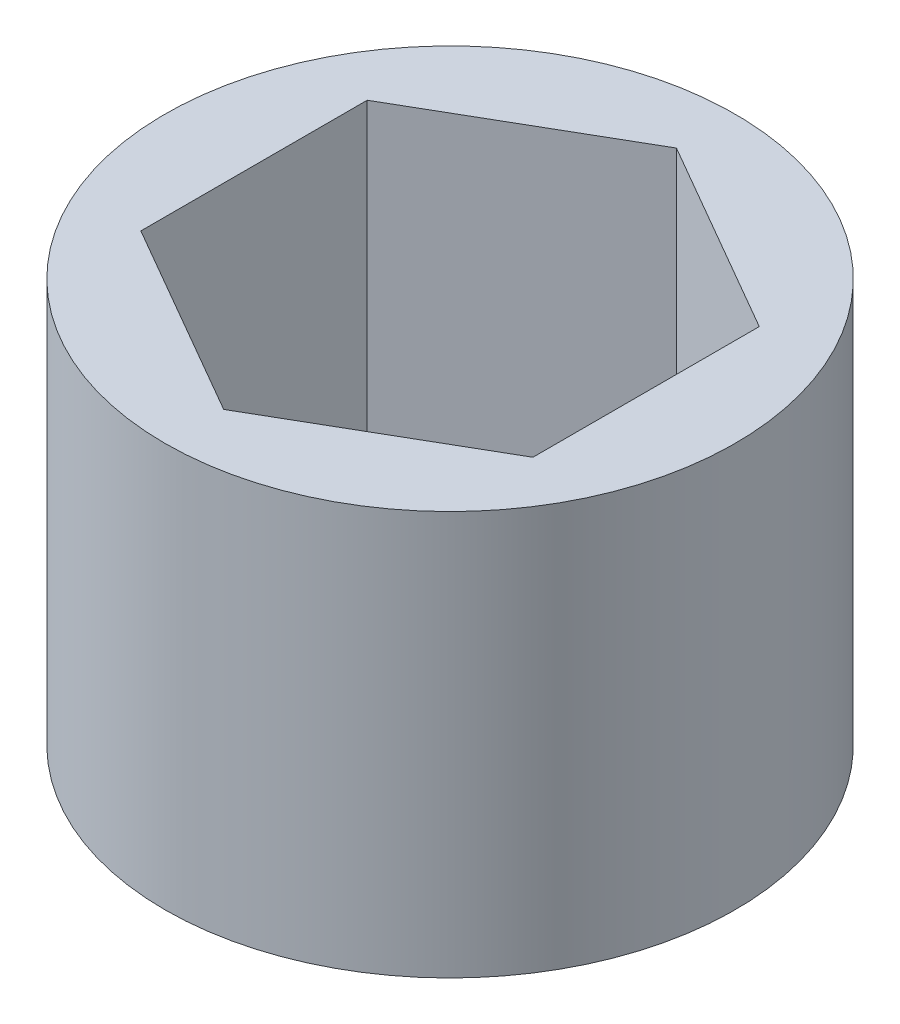
ISO-10303-21;
HEADER;
FILE_DESCRIPTION(('STEP AP214'),'2;1');
FILE_NAME('part.step','',(''),(''),'','','');
FILE_SCHEMA(('AUTOMOTIVE_DESIGN { 1 0 10303 214 1 1 1 1 }'));
ENDSEC;
DATA;
#1=APPLICATION_CONTEXT('core data for automotive mechanical design processes');
#2=APPLICATION_PROTOCOL_DEFINITION('international standard','automotive_design',2000,#1);
#3=PRODUCT_CONTEXT('',#1,'mechanical');
#4=PRODUCT('Part','Part','',(#3));
#5=PRODUCT_RELATED_PRODUCT_CATEGORY('part','',(#4));
#6=PRODUCT_DEFINITION_FORMATION('','',#4);
#7=PRODUCT_DEFINITION_CONTEXT('part definition',#1,'design');
#8=PRODUCT_DEFINITION('design','',#6,#7);
#9=PRODUCT_DEFINITION_SHAPE('','',#8);
#10=(LENGTH_UNIT() NAMED_UNIT(*) SI_UNIT(.MILLI.,.METRE.));
#11=(NAMED_UNIT(*) PLANE_ANGLE_UNIT() SI_UNIT($,.RADIAN.));
#12=(NAMED_UNIT(*) SI_UNIT($,.STERADIAN.) SOLID_ANGLE_UNIT());
#13=UNCERTAINTY_MEASURE_WITH_UNIT(LENGTH_MEASURE(1.E-05),#10,'distance_accuracy_value','');
#14=(GEOMETRIC_REPRESENTATION_CONTEXT(3) GLOBAL_UNCERTAINTY_ASSIGNED_CONTEXT((#13)) GLOBAL_UNIT_ASSIGNED_CONTEXT((#10,
#11,#12)) REPRESENTATION_CONTEXT('',''));
#15=CARTESIAN_POINT('',(0.,0.,0.));
#16=DIRECTION('',(0.,0.,1.));
#17=DIRECTION('',(1.,0.,0.));
#18=AXIS2_PLACEMENT_3D('',#15,#16,#17);
#19=CARTESIAN_POINT('',(0.,13.49375,0.));
#20=DIRECTION('',(0.,1.,0.));
#21=DIRECTION('',(0.,0.,1.));
#22=AXIS2_PLACEMENT_3D('',#19,#20,#21);
#23=PLANE('',#22);
#24=CARTESIAN_POINT('',(0.,13.49375,0.));
#25=DIRECTION('',(0.,1.,0.));
#26=DIRECTION('',(0.,0.,1.));
#27=AXIS2_PLACEMENT_3D('',#24,#25,#26);
#28=CIRCLE('',#27,9.525);
#29=CARTESIAN_POINT('',(0.,13.49375,9.525));
#30=VERTEX_POINT('',#29);
#31=EDGE_CURVE('E11',#30,#30,#28,.T.);
#32=ORIENTED_EDGE('',*,*,#31,.T.);
#33=EDGE_LOOP('',(#32));
#34=FACE_BOUND('',#33,.T.);
#35=DIRECTION('',(-0.866025403784439,0.,0.5));
#36=VECTOR('',#35,1.);
#37=CARTESIAN_POINT('',(0.,13.49375,-7.56148430679288));
#38=LINE('',#37,#36);
#39=CARTESIAN_POINT('',(0.,13.49375,-7.56148430679288));
#40=VERTEX_POINT('',#39);
#41=CARTESIAN_POINT('',(-6.5484375,13.49375,-3.78074215339644));
#42=VERTEX_POINT('',#41);
#43=EDGE_CURVE('E102',#40,#42,#38,.T.);
#44=ORIENTED_EDGE('',*,*,#43,.F.);
#45=DIRECTION('',(-0.866025403784439,0.,-0.5));
#46=VECTOR('',#45,1.);
#47=CARTESIAN_POINT('',(6.5484375,13.49375,-3.78074215339644));
#48=LINE('',#47,#46);
#49=CARTESIAN_POINT('',(6.5484375,13.49375,-3.78074215339644));
#50=VERTEX_POINT('',#49);
#51=EDGE_CURVE('E93',#50,#40,#48,.T.);
#52=ORIENTED_EDGE('',*,*,#51,.F.);
#53=DIRECTION('',(0.,0.,-1.));
#54=VECTOR('',#53,1.);
#55=CARTESIAN_POINT('',(6.5484375,13.49375,3.78074215339644));
#56=LINE('',#55,#54);
#57=CARTESIAN_POINT('',(6.5484375,13.49375,3.78074215339644));
#58=VERTEX_POINT('',#57);
#59=EDGE_CURVE('E127',#58,#50,#56,.T.);
#60=ORIENTED_EDGE('',*,*,#59,.F.);
#61=DIRECTION('',(0.866025403784439,0.,-0.5));
#62=VECTOR('',#61,1.);
#63=CARTESIAN_POINT('',(0.,13.49375,7.56148430679288));
#64=LINE('',#63,#62);
#65=CARTESIAN_POINT('',(0.,13.49375,7.56148430679288));
#66=VERTEX_POINT('',#65);
#67=EDGE_CURVE('E124',#66,#58,#64,.T.);
#68=ORIENTED_EDGE('',*,*,#67,.F.);
#69=DIRECTION('',(0.866025403784439,0.,0.5));
#70=VECTOR('',#69,1.);
#71=CARTESIAN_POINT('',(-6.5484375,13.49375,3.78074215339644));
#72=LINE('',#71,#70);
#73=CARTESIAN_POINT('',(-6.5484375,13.49375,3.78074215339644));
#74=VERTEX_POINT('',#73);
#75=EDGE_CURVE('E119',#74,#66,#72,.T.);
#76=ORIENTED_EDGE('',*,*,#75,.F.);
#77=DIRECTION('',(0.,0.,1.));
#78=VECTOR('',#77,1.);
#79=CARTESIAN_POINT('',(-6.5484375,13.49375,-3.78074215339644));
#80=LINE('',#79,#78);
#81=EDGE_CURVE('E115',#42,#74,#80,.T.);
#82=ORIENTED_EDGE('',*,*,#81,.F.);
#83=EDGE_LOOP('',(#44,#52,#60,#68,#76,#82));
#84=FACE_BOUND('',#83,.T.);
#85=ADVANCED_FACE('F39',(#34,#84),#23,.T.);
#86=CARTESIAN_POINT('',(0.,0.,0.));
#87=DIRECTION('',(0.,1.,0.));
#88=DIRECTION('',(0.,0.,1.));
#89=AXIS2_PLACEMENT_3D('',#86,#87,#88);
#90=PLANE('',#89);
#91=CARTESIAN_POINT('',(0.,0.,0.));
#92=DIRECTION('',(0.,1.,0.));
#93=DIRECTION('',(0.,0.,1.));
#94=AXIS2_PLACEMENT_3D('',#91,#92,#93);
#95=CIRCLE('',#94,9.525);
#96=CARTESIAN_POINT('',(0.,0.,9.525));
#97=VERTEX_POINT('',#96);
#98=EDGE_CURVE('E43',#97,#97,#95,.T.);
#99=ORIENTED_EDGE('',*,*,#98,.F.);
#100=EDGE_LOOP('',(#99));
#101=FACE_BOUND('',#100,.T.);
#102=DIRECTION('',(-0.866025403784439,0.,-0.5));
#103=VECTOR('',#102,1.);
#104=CARTESIAN_POINT('',(6.5484375,0.,-3.78074215339644));
#105=LINE('',#104,#103);
#106=CARTESIAN_POINT('',(6.5484375,0.,-3.78074215339644));
#107=VERTEX_POINT('',#106);
#108=CARTESIAN_POINT('',(0.,0.,-7.56148430679288));
#109=VERTEX_POINT('',#108);
#110=EDGE_CURVE('E63',#107,#109,#105,.T.);
#111=ORIENTED_EDGE('',*,*,#110,.T.);
#112=DIRECTION('',(-0.866025403784439,0.,0.5));
#113=VECTOR('',#112,1.);
#114=CARTESIAN_POINT('',(0.,0.,-7.56148430679288));
#115=LINE('',#114,#113);
#116=CARTESIAN_POINT('',(-6.5484375,0.,-3.78074215339644));
#117=VERTEX_POINT('',#116);
#118=EDGE_CURVE('E109',#109,#117,#115,.T.);
#119=ORIENTED_EDGE('',*,*,#118,.T.);
#120=DIRECTION('',(0.,0.,1.));
#121=VECTOR('',#120,1.);
#122=CARTESIAN_POINT('',(-6.5484375,0.,-3.78074215339644));
#123=LINE('',#122,#121);
#124=CARTESIAN_POINT('',(-6.5484375,0.,3.78074215339644));
#125=VERTEX_POINT('',#124);
#126=EDGE_CURVE('E134',#117,#125,#123,.T.);
#127=ORIENTED_EDGE('',*,*,#126,.T.);
#128=DIRECTION('',(0.866025403784439,0.,0.5));
#129=VECTOR('',#128,1.);
#130=CARTESIAN_POINT('',(-6.5484375,0.,3.78074215339644));
#131=LINE('',#130,#129);
#132=CARTESIAN_POINT('',(0.,0.,7.56148430679288));
#133=VERTEX_POINT('',#132);
#134=EDGE_CURVE('E138',#125,#133,#131,.T.);
#135=ORIENTED_EDGE('',*,*,#134,.T.);
#136=DIRECTION('',(0.866025403784439,0.,-0.5));
#137=VECTOR('',#136,1.);
#138=CARTESIAN_POINT('',(0.,0.,7.56148430679288));
#139=LINE('',#138,#137);
#140=CARTESIAN_POINT('',(6.5484375,0.,3.78074215339644));
#141=VERTEX_POINT('',#140);
#142=EDGE_CURVE('E142',#133,#141,#139,.T.);
#143=ORIENTED_EDGE('',*,*,#142,.T.);
#144=DIRECTION('',(0.,0.,-1.));
#145=VECTOR('',#144,1.);
#146=CARTESIAN_POINT('',(6.5484375,0.,3.78074215339644));
#147=LINE('',#146,#145);
#148=EDGE_CURVE('E103',#141,#107,#147,.T.);
#149=ORIENTED_EDGE('',*,*,#148,.T.);
#150=EDGE_LOOP('',(#111,#119,#127,#135,#143,#149));
#151=FACE_BOUND('',#150,.T.);
#152=ADVANCED_FACE('F166',(#101,#151),#90,.F.);
#153=CARTESIAN_POINT('',(0.,13.49375,0.));
#154=DIRECTION('',(0.,-1.,0.));
#155=DIRECTION('',(0.,0.,-1.));
#156=AXIS2_PLACEMENT_3D('',#153,#154,#155);
#157=CYLINDRICAL_SURFACE('',#156,9.525);
#158=ORIENTED_EDGE('',*,*,#31,.F.);
#159=EDGE_LOOP('',(#158));
#160=FACE_BOUND('',#159,.T.);
#161=ORIENTED_EDGE('',*,*,#98,.T.);
#162=EDGE_LOOP('',(#161));
#163=FACE_BOUND('',#162,.T.);
#164=ADVANCED_FACE('F41',(#160,#163),#157,.T.);
#165=CARTESIAN_POINT('',(6.5484375,13.49375,-3.78074215339644));
#166=DIRECTION('',(-0.5,0.,0.866025403784439));
#167=DIRECTION('',(0.866025403784439,0.,0.5));
#168=AXIS2_PLACEMENT_3D('',#165,#166,#167);
#169=PLANE('',#168);
#170=ORIENTED_EDGE('',*,*,#110,.F.);
#171=DIRECTION('',(0.,-1.,0.));
#172=VECTOR('',#171,1.);
#173=CARTESIAN_POINT('',(6.5484375,13.49375,-3.78074215339644));
#174=LINE('',#173,#172);
#175=EDGE_CURVE('E97',#50,#107,#174,.T.);
#176=ORIENTED_EDGE('',*,*,#175,.F.);
#177=ORIENTED_EDGE('',*,*,#51,.T.);
#178=DIRECTION('',(0.,-1.,0.));
#179=VECTOR('',#178,1.);
#180=CARTESIAN_POINT('',(0.,13.49375,-7.56148430679288));
#181=LINE('',#180,#179);
#182=EDGE_CURVE('E96',#40,#109,#181,.T.);
#183=ORIENTED_EDGE('',*,*,#182,.T.);
#184=EDGE_LOOP('',(#170,#176,#177,#183));
#185=FACE_BOUND('',#184,.T.);
#186=ADVANCED_FACE('F95',(#185),#169,.T.);
#187=CARTESIAN_POINT('',(0.,13.49375,-7.56148430679288));
#188=DIRECTION('',(0.5,0.,0.866025403784439));
#189=DIRECTION('',(0.866025403784439,0.,-0.5));
#190=AXIS2_PLACEMENT_3D('',#187,#188,#189);
#191=PLANE('',#190);
#192=ORIENTED_EDGE('',*,*,#118,.F.);
#193=ORIENTED_EDGE('',*,*,#182,.F.);
#194=ORIENTED_EDGE('',*,*,#43,.T.);
#195=DIRECTION('',(0.,-1.,0.));
#196=VECTOR('',#195,1.);
#197=CARTESIAN_POINT('',(-6.5484375,13.49375,-3.78074215339644));
#198=LINE('',#197,#196);
#199=EDGE_CURVE('E111',#42,#117,#198,.T.);
#200=ORIENTED_EDGE('',*,*,#199,.T.);
#201=EDGE_LOOP('',(#192,#193,#194,#200));
#202=FACE_BOUND('',#201,.T.);
#203=ADVANCED_FACE('F106',(#202),#191,.T.);
#204=CARTESIAN_POINT('',(-6.5484375,13.49375,-3.78074215339644));
#205=DIRECTION('',(1.,0.,0.));
#206=DIRECTION('',(0.,0.,-1.));
#207=AXIS2_PLACEMENT_3D('',#204,#205,#206);
#208=PLANE('',#207);
#209=ORIENTED_EDGE('',*,*,#126,.F.);
#210=ORIENTED_EDGE('',*,*,#199,.F.);
#211=ORIENTED_EDGE('',*,*,#81,.T.);
#212=DIRECTION('',(0.,-1.,0.));
#213=VECTOR('',#212,1.);
#214=CARTESIAN_POINT('',(-6.5484375,13.49375,3.78074215339644));
#215=LINE('',#214,#213);
#216=EDGE_CURVE('E156',#74,#125,#215,.T.);
#217=ORIENTED_EDGE('',*,*,#216,.T.);
#218=EDGE_LOOP('',(#209,#210,#211,#217));
#219=FACE_BOUND('',#218,.T.);
#220=ADVANCED_FACE('F162',(#219),#208,.T.);
#221=CARTESIAN_POINT('',(-6.5484375,13.49375,3.78074215339644));
#222=DIRECTION('',(0.5,0.,-0.866025403784439));
#223=DIRECTION('',(-0.866025403784439,0.,-0.5));
#224=AXIS2_PLACEMENT_3D('',#221,#222,#223);
#225=PLANE('',#224);
#226=ORIENTED_EDGE('',*,*,#134,.F.);
#227=ORIENTED_EDGE('',*,*,#216,.F.);
#228=ORIENTED_EDGE('',*,*,#75,.T.);
#229=DIRECTION('',(0.,-1.,0.));
#230=VECTOR('',#229,1.);
#231=CARTESIAN_POINT('',(0.,13.49375,7.56148430679288));
#232=LINE('',#231,#230);
#233=EDGE_CURVE('E153',#66,#133,#232,.T.);
#234=ORIENTED_EDGE('',*,*,#233,.T.);
#235=EDGE_LOOP('',(#226,#227,#228,#234));
#236=FACE_BOUND('',#235,.T.);
#237=ADVANCED_FACE('F174',(#236),#225,.T.);
#238=CARTESIAN_POINT('',(0.,13.49375,7.56148430679288));
#239=DIRECTION('',(-0.5,0.,-0.866025403784439));
#240=DIRECTION('',(-0.866025403784439,0.,0.5));
#241=AXIS2_PLACEMENT_3D('',#238,#239,#240);
#242=PLANE('',#241);
#243=ORIENTED_EDGE('',*,*,#142,.F.);
#244=ORIENTED_EDGE('',*,*,#233,.F.);
#245=ORIENTED_EDGE('',*,*,#67,.T.);
#246=DIRECTION('',(0.,-1.,0.));
#247=VECTOR('',#246,1.);
#248=CARTESIAN_POINT('',(6.5484375,13.49375,3.78074215339644));
#249=LINE('',#248,#247);
#250=EDGE_CURVE('E55',#58,#141,#249,.T.);
#251=ORIENTED_EDGE('',*,*,#250,.T.);
#252=EDGE_LOOP('',(#243,#244,#245,#251));
#253=FACE_BOUND('',#252,.T.);
#254=ADVANCED_FACE('F172',(#253),#242,.T.);
#255=CARTESIAN_POINT('',(6.5484375,13.49375,3.78074215339644));
#256=DIRECTION('',(-1.,0.,0.));
#257=DIRECTION('',(0.,0.,1.));
#258=AXIS2_PLACEMENT_3D('',#255,#256,#257);
#259=PLANE('',#258);
#260=ORIENTED_EDGE('',*,*,#148,.F.);
#261=ORIENTED_EDGE('',*,*,#250,.F.);
#262=ORIENTED_EDGE('',*,*,#59,.T.);
#263=ORIENTED_EDGE('',*,*,#175,.T.);
#264=EDGE_LOOP('',(#260,#261,#262,#263));
#265=FACE_BOUND('',#264,.T.);
#266=ADVANCED_FACE('F168',(#265),#259,.T.);
#267=CLOSED_SHELL('',(#85,#152,#164,#186,#203,#220,#237,#254,#266));
#268=MANIFOLD_SOLID_BREP('B2',#267);
#269=ADVANCED_BREP_SHAPE_REPRESENTATION('',(#18,#268),#14);
#270=SHAPE_DEFINITION_REPRESENTATION(#9,#269);
ENDSEC;
END-ISO-10303-21;
